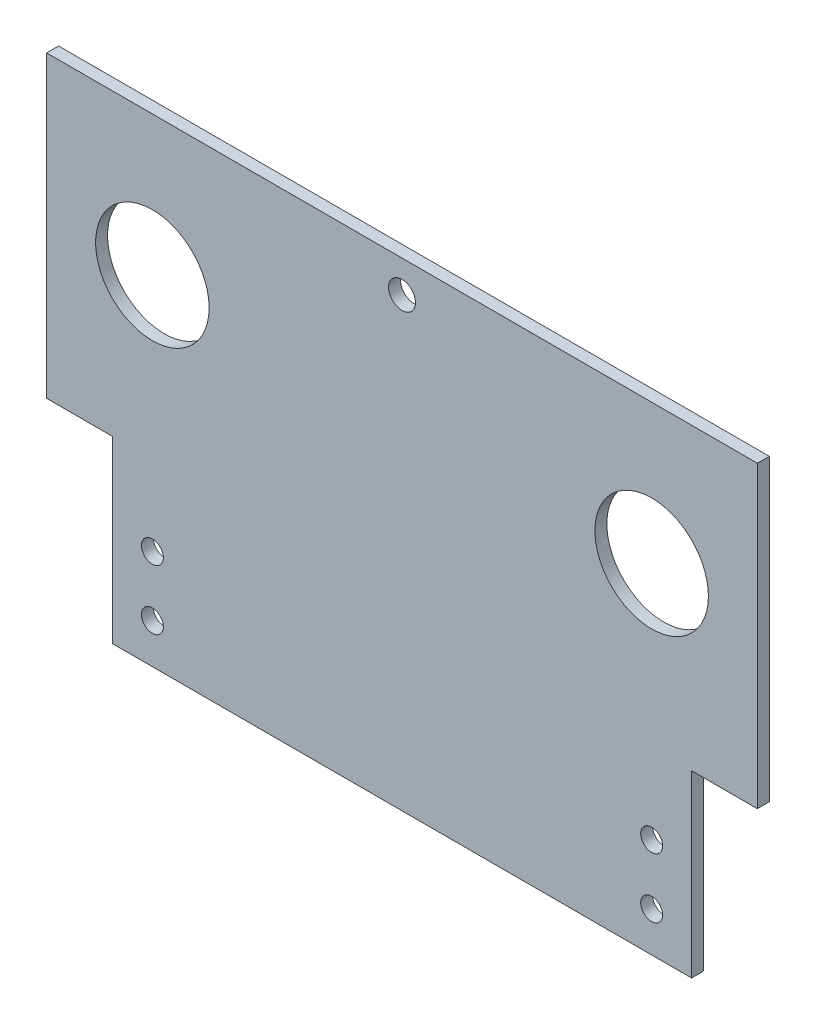
ISO-10303-21;
HEADER;
FILE_DESCRIPTION(('STEP AP214'),'2;1');
FILE_NAME('part.step','',(''),(''),'','','');
FILE_SCHEMA(('AUTOMOTIVE_DESIGN { 1 0 10303 214 1 1 1 1 }'));
ENDSEC;
DATA;
#1=APPLICATION_CONTEXT('core data for automotive mechanical design processes');
#2=APPLICATION_PROTOCOL_DEFINITION('international standard','automotive_design',2000,#1);
#3=PRODUCT_CONTEXT('',#1,'mechanical');
#4=PRODUCT('Part','Part','',(#3));
#5=PRODUCT_RELATED_PRODUCT_CATEGORY('part','',(#4));
#6=PRODUCT_DEFINITION_FORMATION('','',#4);
#7=PRODUCT_DEFINITION_CONTEXT('part definition',#1,'design');
#8=PRODUCT_DEFINITION('design','',#6,#7);
#9=PRODUCT_DEFINITION_SHAPE('','',#8);
#10=(LENGTH_UNIT() NAMED_UNIT(*) SI_UNIT(.MILLI.,.METRE.));
#11=(NAMED_UNIT(*) PLANE_ANGLE_UNIT() SI_UNIT($,.RADIAN.));
#12=(NAMED_UNIT(*) SI_UNIT($,.STERADIAN.) SOLID_ANGLE_UNIT());
#13=UNCERTAINTY_MEASURE_WITH_UNIT(LENGTH_MEASURE(1.E-05),#10,'distance_accuracy_value','');
#14=(GEOMETRIC_REPRESENTATION_CONTEXT(3) GLOBAL_UNCERTAINTY_ASSIGNED_CONTEXT((#13)) GLOBAL_UNIT_ASSIGNED_CONTEXT((#10,
#11,#12)) REPRESENTATION_CONTEXT('',''));
#15=CARTESIAN_POINT('',(0.,0.,0.));
#16=DIRECTION('',(0.,0.,1.));
#17=DIRECTION('',(1.,0.,0.));
#18=AXIS2_PLACEMENT_3D('',#15,#16,#17);
#19=CARTESIAN_POINT('',(0.,0.,3.));
#20=DIRECTION('',(1.,0.,0.));
#21=DIRECTION('',(0.,1.,0.));
#22=AXIS2_PLACEMENT_3D('',#19,#20,#21);
#23=PLANE('',#22);
#24=DIRECTION('',(0.,0.,-1.));
#25=VECTOR('',#24,1.);
#26=CARTESIAN_POINT('',(0.,-75.,3.));
#27=LINE('',#26,#25);
#28=CARTESIAN_POINT('',(0.,-75.,3.));
#29=VERTEX_POINT('',#28);
#30=CARTESIAN_POINT('',(0.,-75.,0.));
#31=VERTEX_POINT('',#30);
#32=EDGE_CURVE('E104',#29,#31,#27,.T.);
#33=ORIENTED_EDGE('',*,*,#32,.F.);
#34=DIRECTION('',(0.,-1.,0.));
#35=VECTOR('',#34,1.);
#36=CARTESIAN_POINT('',(0.,0.,3.));
#37=LINE('',#36,#35);
#38=CARTESIAN_POINT('',(0.,0.,3.));
#39=VERTEX_POINT('',#38);
#40=EDGE_CURVE('E120',#39,#29,#37,.T.);
#41=ORIENTED_EDGE('',*,*,#40,.F.);
#42=DIRECTION('',(0.,0.,-1.));
#43=VECTOR('',#42,1.);
#44=CARTESIAN_POINT('',(0.,0.,3.));
#45=LINE('',#44,#43);
#46=CARTESIAN_POINT('',(0.,0.,0.));
#47=VERTEX_POINT('',#46);
#48=EDGE_CURVE('E46',#39,#47,#45,.T.);
#49=ORIENTED_EDGE('',*,*,#48,.T.);
#50=DIRECTION('',(0.,-1.,0.));
#51=VECTOR('',#50,1.);
#52=CARTESIAN_POINT('',(0.,0.,0.));
#53=LINE('',#52,#51);
#54=EDGE_CURVE('E118',#47,#31,#53,.T.);
#55=ORIENTED_EDGE('',*,*,#54,.T.);
#56=EDGE_LOOP('',(#33,#41,#49,#55));
#57=FACE_BOUND('',#56,.T.);
#58=ADVANCED_FACE('F39',(#57),#23,.F.);
#59=CARTESIAN_POINT('',(0.,-120.,3.));
#60=DIRECTION('',(0.,1.,0.));
#61=DIRECTION('',(0.,0.,1.));
#62=AXIS2_PLACEMENT_3D('',#59,#60,#61);
#63=PLANE('',#62);
#64=DIRECTION('',(1.,0.,0.));
#65=VECTOR('',#64,1.);
#66=CARTESIAN_POINT('',(0.,-120.,3.));
#67=LINE('',#66,#65);
#68=CARTESIAN_POINT('',(16.5,-120.,3.));
#69=VERTEX_POINT('',#68);
#70=CARTESIAN_POINT('',(161.66,-120.,3.));
#71=VERTEX_POINT('',#70);
#72=EDGE_CURVE('E123',#69,#71,#67,.T.);
#73=ORIENTED_EDGE('',*,*,#72,.F.);
#74=DIRECTION('',(0.,0.,-1.));
#75=VECTOR('',#74,1.);
#76=CARTESIAN_POINT('',(16.5,-120.,3.));
#77=LINE('',#76,#75);
#78=CARTESIAN_POINT('',(16.5,-120.,0.));
#79=VERTEX_POINT('',#78);
#80=EDGE_CURVE('E160',#69,#79,#77,.T.);
#81=ORIENTED_EDGE('',*,*,#80,.T.);
#82=DIRECTION('',(1.,0.,0.));
#83=VECTOR('',#82,1.);
#84=CARTESIAN_POINT('',(0.,-120.,0.));
#85=LINE('',#84,#83);
#86=CARTESIAN_POINT('',(161.66,-120.,0.));
#87=VERTEX_POINT('',#86);
#88=EDGE_CURVE('E139',#79,#87,#85,.T.);
#89=ORIENTED_EDGE('',*,*,#88,.T.);
#90=DIRECTION('',(0.,0.,-1.));
#91=VECTOR('',#90,1.);
#92=CARTESIAN_POINT('',(161.66,-120.,3.));
#93=LINE('',#92,#91);
#94=EDGE_CURVE('E162',#71,#87,#93,.T.);
#95=ORIENTED_EDGE('',*,*,#94,.F.);
#96=EDGE_LOOP('',(#73,#81,#89,#95));
#97=FACE_BOUND('',#96,.T.);
#98=ADVANCED_FACE('F218',(#97),#63,.F.);
#99=CARTESIAN_POINT('',(0.,0.,3.));
#100=DIRECTION('',(0.,0.,1.));
#101=DIRECTION('',(1.,0.,0.));
#102=AXIS2_PLACEMENT_3D('',#99,#100,#101);
#103=PLANE('',#102);
#104=CARTESIAN_POINT('',(89.08,-8.00000000000002,3.));
#105=DIRECTION('',(0.,0.,1.));
#106=DIRECTION('',(1.,0.,0.));
#107=AXIS2_PLACEMENT_3D('',#104,#105,#106);
#108=CIRCLE('',#107,3.375);
#109=CARTESIAN_POINT('',(92.455,-8.00000000000002,3.));
#110=VERTEX_POINT('',#109);
#111=EDGE_CURVE('E193',#110,#110,#108,.T.);
#112=ORIENTED_EDGE('',*,*,#111,.F.);
#113=EDGE_LOOP('',(#112));
#114=FACE_BOUND('',#113,.T.);
#115=CARTESIAN_POINT('',(151.66,-110.,3.));
#116=DIRECTION('',(0.,0.,1.));
#117=DIRECTION('',(1.,0.,0.));
#118=AXIS2_PLACEMENT_3D('',#115,#116,#117);
#119=CIRCLE('',#118,2.75000000000001);
#120=CARTESIAN_POINT('',(154.41,-110.,3.));
#121=VERTEX_POINT('',#120);
#122=EDGE_CURVE('E189',#121,#121,#119,.T.);
#123=ORIENTED_EDGE('',*,*,#122,.F.);
#124=EDGE_LOOP('',(#123));
#125=FACE_BOUND('',#124,.T.);
#126=CARTESIAN_POINT('',(26.5,-110.,3.));
#127=DIRECTION('',(0.,0.,1.));
#128=DIRECTION('',(1.,0.,0.));
#129=AXIS2_PLACEMENT_3D('',#126,#127,#128);
#130=CIRCLE('',#129,2.75);
#131=CARTESIAN_POINT('',(29.25,-110.,3.));
#132=VERTEX_POINT('',#131);
#133=EDGE_CURVE('E207',#132,#132,#130,.T.);
#134=ORIENTED_EDGE('',*,*,#133,.F.);
#135=EDGE_LOOP('',(#134));
#136=FACE_BOUND('',#135,.T.);
#137=CARTESIAN_POINT('',(151.66,-35.,3.));
#138=DIRECTION('',(0.,0.,1.));
#139=DIRECTION('',(1.,0.,0.));
#140=AXIS2_PLACEMENT_3D('',#137,#138,#139);
#141=CIRCLE('',#140,14.225);
#142=CARTESIAN_POINT('',(165.885,-35.,3.));
#143=VERTEX_POINT('',#142);
#144=EDGE_CURVE('E197',#143,#143,#141,.T.);
#145=ORIENTED_EDGE('',*,*,#144,.F.);
#146=EDGE_LOOP('',(#145));
#147=FACE_BOUND('',#146,.T.);
#148=CARTESIAN_POINT('',(26.5,-95.,3.));
#149=DIRECTION('',(0.,0.,1.));
#150=DIRECTION('',(1.,0.,0.));
#151=AXIS2_PLACEMENT_3D('',#148,#149,#150);
#152=CIRCLE('',#151,2.75);
#153=CARTESIAN_POINT('',(29.25,-95.,3.));
#154=VERTEX_POINT('',#153);
#155=EDGE_CURVE('E176',#154,#154,#152,.T.);
#156=ORIENTED_EDGE('',*,*,#155,.F.);
#157=EDGE_LOOP('',(#156));
#158=FACE_BOUND('',#157,.T.);
#159=CARTESIAN_POINT('',(151.66,-95.,3.));
#160=DIRECTION('',(0.,0.,1.));
#161=DIRECTION('',(1.,0.,0.));
#162=AXIS2_PLACEMENT_3D('',#159,#160,#161);
#163=CIRCLE('',#162,2.75000000000001);
#164=CARTESIAN_POINT('',(154.41,-95.,3.));
#165=VERTEX_POINT('',#164);
#166=EDGE_CURVE('E182',#165,#165,#163,.T.);
#167=ORIENTED_EDGE('',*,*,#166,.F.);
#168=EDGE_LOOP('',(#167));
#169=FACE_BOUND('',#168,.T.);
#170=CARTESIAN_POINT('',(26.5,-35.,3.));
#171=DIRECTION('',(0.,0.,1.));
#172=DIRECTION('',(1.,0.,0.));
#173=AXIS2_PLACEMENT_3D('',#170,#171,#172);
#174=CIRCLE('',#173,14.225);
#175=CARTESIAN_POINT('',(40.725,-35.,3.));
#176=VERTEX_POINT('',#175);
#177=EDGE_CURVE('E133',#176,#176,#174,.T.);
#178=ORIENTED_EDGE('',*,*,#177,.F.);
#179=EDGE_LOOP('',(#178));
#180=FACE_BOUND('',#179,.T.);
#181=DIRECTION('',(1.,0.,0.));
#182=VECTOR('',#181,1.);
#183=CARTESIAN_POINT('',(0.,-75.,3.));
#184=LINE('',#183,#182);
#185=CARTESIAN_POINT('',(16.5,-75.,3.));
#186=VERTEX_POINT('',#185);
#187=EDGE_CURVE('E103',#29,#186,#184,.T.);
#188=ORIENTED_EDGE('',*,*,#187,.T.);
#189=DIRECTION('',(0.,-1.,0.));
#190=VECTOR('',#189,1.);
#191=CARTESIAN_POINT('',(16.5,-120.,3.));
#192=LINE('',#191,#190);
#193=EDGE_CURVE('E109',#186,#69,#192,.T.);
#194=ORIENTED_EDGE('',*,*,#193,.T.);
#195=ORIENTED_EDGE('',*,*,#72,.T.);
#196=DIRECTION('',(0.,1.,0.));
#197=VECTOR('',#196,1.);
#198=CARTESIAN_POINT('',(161.66,-120.,3.));
#199=LINE('',#198,#197);
#200=CARTESIAN_POINT('',(161.66,-75.,3.));
#201=VERTEX_POINT('',#200);
#202=EDGE_CURVE('E167',#71,#201,#199,.T.);
#203=ORIENTED_EDGE('',*,*,#202,.T.);
#204=DIRECTION('',(1.,0.,0.));
#205=VECTOR('',#204,1.);
#206=CARTESIAN_POINT('',(178.16,-75.,3.));
#207=LINE('',#206,#205);
#208=CARTESIAN_POINT('',(178.16,-75.,3.));
#209=VERTEX_POINT('',#208);
#210=EDGE_CURVE('E165',#201,#209,#207,.T.);
#211=ORIENTED_EDGE('',*,*,#210,.T.);
#212=DIRECTION('',(0.,1.,0.));
#213=VECTOR('',#212,1.);
#214=CARTESIAN_POINT('',(178.16,0.,3.));
#215=LINE('',#214,#213);
#216=CARTESIAN_POINT('',(178.16,0.,3.));
#217=VERTEX_POINT('',#216);
#218=EDGE_CURVE('E126',#209,#217,#215,.T.);
#219=ORIENTED_EDGE('',*,*,#218,.T.);
#220=DIRECTION('',(-1.,0.,0.));
#221=VECTOR('',#220,1.);
#222=CARTESIAN_POINT('',(0.,0.,3.));
#223=LINE('',#222,#221);
#224=EDGE_CURVE('E124',#217,#39,#223,.T.);
#225=ORIENTED_EDGE('',*,*,#224,.T.);
#226=ORIENTED_EDGE('',*,*,#40,.T.);
#227=EDGE_LOOP('',(#188,#194,#195,#203,#211,#219,#225,#226));
#228=FACE_BOUND('',#227,.T.);
#229=ADVANCED_FACE('F122',(#114,#125,#136,#147,#158,#169,#180,#228),#103,.T.);
#230=CARTESIAN_POINT('',(0.,0.,0.));
#231=DIRECTION('',(0.,0.,1.));
#232=DIRECTION('',(1.,0.,0.));
#233=AXIS2_PLACEMENT_3D('',#230,#231,#232);
#234=PLANE('',#233);
#235=CARTESIAN_POINT('',(89.08,-8.00000000000002,0.));
#236=DIRECTION('',(0.,0.,1.));
#237=DIRECTION('',(1.,0.,0.));
#238=AXIS2_PLACEMENT_3D('',#235,#236,#237);
#239=CIRCLE('',#238,3.375);
#240=CARTESIAN_POINT('',(92.455,-8.00000000000002,0.));
#241=VERTEX_POINT('',#240);
#242=EDGE_CURVE('E177',#241,#241,#239,.T.);
#243=ORIENTED_EDGE('',*,*,#242,.T.);
#244=EDGE_LOOP('',(#243));
#245=FACE_BOUND('',#244,.T.);
#246=CARTESIAN_POINT('',(151.66,-110.,0.));
#247=DIRECTION('',(0.,0.,1.));
#248=DIRECTION('',(1.,0.,0.));
#249=AXIS2_PLACEMENT_3D('',#246,#247,#248);
#250=CIRCLE('',#249,2.75000000000001);
#251=CARTESIAN_POINT('',(154.41,-110.,0.));
#252=VERTEX_POINT('',#251);
#253=EDGE_CURVE('E195',#252,#252,#250,.T.);
#254=ORIENTED_EDGE('',*,*,#253,.T.);
#255=EDGE_LOOP('',(#254));
#256=FACE_BOUND('',#255,.T.);
#257=CARTESIAN_POINT('',(26.5,-110.,0.));
#258=DIRECTION('',(0.,0.,1.));
#259=DIRECTION('',(1.,0.,0.));
#260=AXIS2_PLACEMENT_3D('',#257,#258,#259);
#261=CIRCLE('',#260,2.75);
#262=CARTESIAN_POINT('',(29.25,-110.,0.));
#263=VERTEX_POINT('',#262);
#264=EDGE_CURVE('E192',#263,#263,#261,.T.);
#265=ORIENTED_EDGE('',*,*,#264,.T.);
#266=EDGE_LOOP('',(#265));
#267=FACE_BOUND('',#266,.T.);
#268=CARTESIAN_POINT('',(151.66,-35.,0.));
#269=DIRECTION('',(0.,0.,1.));
#270=DIRECTION('',(1.,0.,0.));
#271=AXIS2_PLACEMENT_3D('',#268,#269,#270);
#272=CIRCLE('',#271,14.225);
#273=CARTESIAN_POINT('',(165.885,-35.,0.));
#274=VERTEX_POINT('',#273);
#275=EDGE_CURVE('E203',#274,#274,#272,.T.);
#276=ORIENTED_EDGE('',*,*,#275,.T.);
#277=EDGE_LOOP('',(#276));
#278=FACE_BOUND('',#277,.T.);
#279=CARTESIAN_POINT('',(26.5,-95.,0.));
#280=DIRECTION('',(0.,0.,1.));
#281=DIRECTION('',(1.,0.,0.));
#282=AXIS2_PLACEMENT_3D('',#279,#280,#281);
#283=CIRCLE('',#282,2.75);
#284=CARTESIAN_POINT('',(29.25,-95.,0.));
#285=VERTEX_POINT('',#284);
#286=EDGE_CURVE('E179',#285,#285,#283,.T.);
#287=ORIENTED_EDGE('',*,*,#286,.T.);
#288=EDGE_LOOP('',(#287));
#289=FACE_BOUND('',#288,.T.);
#290=CARTESIAN_POINT('',(151.66,-95.,0.));
#291=DIRECTION('',(0.,0.,1.));
#292=DIRECTION('',(1.,0.,0.));
#293=AXIS2_PLACEMENT_3D('',#290,#291,#292);
#294=CIRCLE('',#293,2.75000000000001);
#295=CARTESIAN_POINT('',(154.41,-95.,0.));
#296=VERTEX_POINT('',#295);
#297=EDGE_CURVE('E159',#296,#296,#294,.T.);
#298=ORIENTED_EDGE('',*,*,#297,.T.);
#299=EDGE_LOOP('',(#298));
#300=FACE_BOUND('',#299,.T.);
#301=CARTESIAN_POINT('',(26.5,-35.,0.));
#302=DIRECTION('',(0.,0.,1.));
#303=DIRECTION('',(1.,0.,0.));
#304=AXIS2_PLACEMENT_3D('',#301,#302,#303);
#305=CIRCLE('',#304,14.225);
#306=CARTESIAN_POINT('',(40.725,-35.,0.));
#307=VERTEX_POINT('',#306);
#308=EDGE_CURVE('E142',#307,#307,#305,.T.);
#309=ORIENTED_EDGE('',*,*,#308,.T.);
#310=EDGE_LOOP('',(#309));
#311=FACE_BOUND('',#310,.T.);
#312=DIRECTION('',(1.,0.,0.));
#313=VECTOR('',#312,1.);
#314=CARTESIAN_POINT('',(0.,-75.,0.));
#315=LINE('',#314,#313);
#316=CARTESIAN_POINT('',(16.5,-75.,0.));
#317=VERTEX_POINT('',#316);
#318=EDGE_CURVE('E52',#31,#317,#315,.T.);
#319=ORIENTED_EDGE('',*,*,#318,.F.);
#320=ORIENTED_EDGE('',*,*,#54,.F.);
#321=DIRECTION('',(-1.,0.,0.));
#322=VECTOR('',#321,1.);
#323=CARTESIAN_POINT('',(0.,0.,0.));
#324=LINE('',#323,#322);
#325=CARTESIAN_POINT('',(178.16,0.,0.));
#326=VERTEX_POINT('',#325);
#327=EDGE_CURVE('E127',#326,#47,#324,.T.);
#328=ORIENTED_EDGE('',*,*,#327,.F.);
#329=DIRECTION('',(0.,1.,0.));
#330=VECTOR('',#329,1.);
#331=CARTESIAN_POINT('',(178.16,0.,0.));
#332=LINE('',#331,#330);
#333=CARTESIAN_POINT('',(178.16,-75.,0.));
#334=VERTEX_POINT('',#333);
#335=EDGE_CURVE('E134',#334,#326,#332,.T.);
#336=ORIENTED_EDGE('',*,*,#335,.F.);
#337=DIRECTION('',(1.,0.,0.));
#338=VECTOR('',#337,1.);
#339=CARTESIAN_POINT('',(178.16,-75.,0.));
#340=LINE('',#339,#338);
#341=CARTESIAN_POINT('',(161.66,-75.,0.));
#342=VERTEX_POINT('',#341);
#343=EDGE_CURVE('E155',#342,#334,#340,.T.);
#344=ORIENTED_EDGE('',*,*,#343,.F.);
#345=DIRECTION('',(0.,1.,0.));
#346=VECTOR('',#345,1.);
#347=CARTESIAN_POINT('',(161.66,-120.,0.));
#348=LINE('',#347,#346);
#349=EDGE_CURVE('E62',#87,#342,#348,.T.);
#350=ORIENTED_EDGE('',*,*,#349,.F.);
#351=ORIENTED_EDGE('',*,*,#88,.F.);
#352=DIRECTION('',(0.,-1.,0.));
#353=VECTOR('',#352,1.);
#354=CARTESIAN_POINT('',(16.5,-120.,0.));
#355=LINE('',#354,#353);
#356=EDGE_CURVE('E111',#317,#79,#355,.T.);
#357=ORIENTED_EDGE('',*,*,#356,.F.);
#358=EDGE_LOOP('',(#319,#320,#328,#336,#344,#350,#351,#357));
#359=FACE_BOUND('',#358,.T.);
#360=ADVANCED_FACE('F150',(#245,#256,#267,#278,#289,#300,#311,#359),#234,.F.);
#361=CARTESIAN_POINT('',(178.16,0.,3.));
#362=DIRECTION('',(-1.,0.,0.));
#363=DIRECTION('',(0.,-1.,0.));
#364=AXIS2_PLACEMENT_3D('',#361,#362,#363);
#365=PLANE('',#364);
#366=ORIENTED_EDGE('',*,*,#218,.F.);
#367=DIRECTION('',(0.,0.,-1.));
#368=VECTOR('',#367,1.);
#369=CARTESIAN_POINT('',(178.16,-75.,3.));
#370=LINE('',#369,#368);
#371=EDGE_CURVE('E170',#209,#334,#370,.T.);
#372=ORIENTED_EDGE('',*,*,#371,.T.);
#373=ORIENTED_EDGE('',*,*,#335,.T.);
#374=DIRECTION('',(0.,0.,-1.));
#375=VECTOR('',#374,1.);
#376=CARTESIAN_POINT('',(178.16,0.,3.));
#377=LINE('',#376,#375);
#378=EDGE_CURVE('E11',#217,#326,#377,.T.);
#379=ORIENTED_EDGE('',*,*,#378,.F.);
#380=EDGE_LOOP('',(#366,#372,#373,#379));
#381=FACE_BOUND('',#380,.T.);
#382=ADVANCED_FACE('F228',(#381),#365,.F.);
#383=CARTESIAN_POINT('',(0.,0.,3.));
#384=DIRECTION('',(0.,-1.,0.));
#385=DIRECTION('',(0.,0.,-1.));
#386=AXIS2_PLACEMENT_3D('',#383,#384,#385);
#387=PLANE('',#386);
#388=ORIENTED_EDGE('',*,*,#327,.T.);
#389=ORIENTED_EDGE('',*,*,#48,.F.);
#390=ORIENTED_EDGE('',*,*,#224,.F.);
#391=ORIENTED_EDGE('',*,*,#378,.T.);
#392=EDGE_LOOP('',(#388,#389,#390,#391));
#393=FACE_BOUND('',#392,.T.);
#394=ADVANCED_FACE('F314',(#393),#387,.F.);
#395=CARTESIAN_POINT('',(26.5,-35.,0.));
#396=DIRECTION('',(0.,0.,1.));
#397=DIRECTION('',(1.,0.,0.));
#398=AXIS2_PLACEMENT_3D('',#395,#396,#397);
#399=CYLINDRICAL_SURFACE('',#398,14.225);
#400=ORIENTED_EDGE('',*,*,#308,.F.);
#401=EDGE_LOOP('',(#400));
#402=FACE_BOUND('',#401,.T.);
#403=ORIENTED_EDGE('',*,*,#177,.T.);
#404=EDGE_LOOP('',(#403));
#405=FACE_BOUND('',#404,.T.);
#406=ADVANCED_FACE('F219',(#402,#405),#399,.F.);
#407=CARTESIAN_POINT('',(151.66,-95.,0.));
#408=DIRECTION('',(0.,0.,1.));
#409=DIRECTION('',(1.,0.,0.));
#410=AXIS2_PLACEMENT_3D('',#407,#408,#409);
#411=CYLINDRICAL_SURFACE('',#410,2.75000000000001);
#412=ORIENTED_EDGE('',*,*,#297,.F.);
#413=EDGE_LOOP('',(#412));
#414=FACE_BOUND('',#413,.T.);
#415=ORIENTED_EDGE('',*,*,#166,.T.);
#416=EDGE_LOOP('',(#415));
#417=FACE_BOUND('',#416,.T.);
#418=ADVANCED_FACE('F296',(#414,#417),#411,.F.);
#419=CARTESIAN_POINT('',(26.5,-95.,0.));
#420=DIRECTION('',(0.,0.,1.));
#421=DIRECTION('',(1.,0.,0.));
#422=AXIS2_PLACEMENT_3D('',#419,#420,#421);
#423=CYLINDRICAL_SURFACE('',#422,2.75);
#424=ORIENTED_EDGE('',*,*,#286,.F.);
#425=EDGE_LOOP('',(#424));
#426=FACE_BOUND('',#425,.T.);
#427=ORIENTED_EDGE('',*,*,#155,.T.);
#428=EDGE_LOOP('',(#427));
#429=FACE_BOUND('',#428,.T.);
#430=ADVANCED_FACE('F287',(#426,#429),#423,.F.);
#431=CARTESIAN_POINT('',(151.66,-35.,0.));
#432=DIRECTION('',(0.,0.,1.));
#433=DIRECTION('',(1.,0.,0.));
#434=AXIS2_PLACEMENT_3D('',#431,#432,#433);
#435=CYLINDRICAL_SURFACE('',#434,14.225);
#436=ORIENTED_EDGE('',*,*,#275,.F.);
#437=EDGE_LOOP('',(#436));
#438=FACE_BOUND('',#437,.T.);
#439=ORIENTED_EDGE('',*,*,#144,.T.);
#440=EDGE_LOOP('',(#439));
#441=FACE_BOUND('',#440,.T.);
#442=ADVANCED_FACE('F278',(#438,#441),#435,.F.);
#443=CARTESIAN_POINT('',(26.5,-110.,0.));
#444=DIRECTION('',(0.,0.,1.));
#445=DIRECTION('',(1.,0.,0.));
#446=AXIS2_PLACEMENT_3D('',#443,#444,#445);
#447=CYLINDRICAL_SURFACE('',#446,2.75);
#448=ORIENTED_EDGE('',*,*,#264,.F.);
#449=EDGE_LOOP('',(#448));
#450=FACE_BOUND('',#449,.T.);
#451=ORIENTED_EDGE('',*,*,#133,.T.);
#452=EDGE_LOOP('',(#451));
#453=FACE_BOUND('',#452,.T.);
#454=ADVANCED_FACE('F272',(#450,#453),#447,.F.);
#455=CARTESIAN_POINT('',(151.66,-110.,0.));
#456=DIRECTION('',(0.,0.,1.));
#457=DIRECTION('',(1.,0.,0.));
#458=AXIS2_PLACEMENT_3D('',#455,#456,#457);
#459=CYLINDRICAL_SURFACE('',#458,2.75000000000001);
#460=ORIENTED_EDGE('',*,*,#253,.F.);
#461=EDGE_LOOP('',(#460));
#462=FACE_BOUND('',#461,.T.);
#463=ORIENTED_EDGE('',*,*,#122,.T.);
#464=EDGE_LOOP('',(#463));
#465=FACE_BOUND('',#464,.T.);
#466=ADVANCED_FACE('F265',(#462,#465),#459,.F.);
#467=CARTESIAN_POINT('',(89.08,-8.00000000000002,0.));
#468=DIRECTION('',(0.,0.,1.));
#469=DIRECTION('',(1.,0.,0.));
#470=AXIS2_PLACEMENT_3D('',#467,#468,#469);
#471=CYLINDRICAL_SURFACE('',#470,3.375);
#472=ORIENTED_EDGE('',*,*,#242,.F.);
#473=EDGE_LOOP('',(#472));
#474=FACE_BOUND('',#473,.T.);
#475=ORIENTED_EDGE('',*,*,#111,.T.);
#476=EDGE_LOOP('',(#475));
#477=FACE_BOUND('',#476,.T.);
#478=ADVANCED_FACE('F241',(#474,#477),#471,.F.);
#479=CARTESIAN_POINT('',(178.16,-75.,3.));
#480=DIRECTION('',(0.,1.,0.));
#481=DIRECTION('',(0.,0.,1.));
#482=AXIS2_PLACEMENT_3D('',#479,#480,#481);
#483=PLANE('',#482);
#484=ORIENTED_EDGE('',*,*,#343,.T.);
#485=ORIENTED_EDGE('',*,*,#371,.F.);
#486=ORIENTED_EDGE('',*,*,#210,.F.);
#487=DIRECTION('',(0.,0.,-1.));
#488=VECTOR('',#487,1.);
#489=CARTESIAN_POINT('',(161.66,-75.,3.));
#490=LINE('',#489,#488);
#491=EDGE_CURVE('E164',#201,#342,#490,.T.);
#492=ORIENTED_EDGE('',*,*,#491,.T.);
#493=EDGE_LOOP('',(#484,#485,#486,#492));
#494=FACE_BOUND('',#493,.T.);
#495=ADVANCED_FACE('F261',(#494),#483,.F.);
#496=CARTESIAN_POINT('',(161.66,-120.,3.));
#497=DIRECTION('',(-1.,0.,0.));
#498=DIRECTION('',(0.,0.,1.));
#499=AXIS2_PLACEMENT_3D('',#496,#497,#498);
#500=PLANE('',#499);
#501=ORIENTED_EDGE('',*,*,#349,.T.);
#502=ORIENTED_EDGE('',*,*,#491,.F.);
#503=ORIENTED_EDGE('',*,*,#202,.F.);
#504=ORIENTED_EDGE('',*,*,#94,.T.);
#505=EDGE_LOOP('',(#501,#502,#503,#504));
#506=FACE_BOUND('',#505,.T.);
#507=ADVANCED_FACE('F339',(#506),#500,.F.);
#508=CARTESIAN_POINT('',(16.5,-120.,3.));
#509=DIRECTION('',(1.,0.,0.));
#510=DIRECTION('',(0.,0.,-1.));
#511=AXIS2_PLACEMENT_3D('',#508,#509,#510);
#512=PLANE('',#511);
#513=ORIENTED_EDGE('',*,*,#356,.T.);
#514=ORIENTED_EDGE('',*,*,#80,.F.);
#515=ORIENTED_EDGE('',*,*,#193,.F.);
#516=DIRECTION('',(0.,0.,-1.));
#517=VECTOR('',#516,1.);
#518=CARTESIAN_POINT('',(16.5,-75.,3.));
#519=LINE('',#518,#517);
#520=EDGE_CURVE('E102',#186,#317,#519,.T.);
#521=ORIENTED_EDGE('',*,*,#520,.T.);
#522=EDGE_LOOP('',(#513,#514,#515,#521));
#523=FACE_BOUND('',#522,.T.);
#524=ADVANCED_FACE('F346',(#523),#512,.F.);
#525=CARTESIAN_POINT('',(0.,-75.,3.));
#526=DIRECTION('',(0.,1.,0.));
#527=DIRECTION('',(0.,0.,1.));
#528=AXIS2_PLACEMENT_3D('',#525,#526,#527);
#529=PLANE('',#528);
#530=ORIENTED_EDGE('',*,*,#318,.T.);
#531=ORIENTED_EDGE('',*,*,#520,.F.);
#532=ORIENTED_EDGE('',*,*,#187,.F.);
#533=ORIENTED_EDGE('',*,*,#32,.T.);
#534=EDGE_LOOP('',(#530,#531,#532,#533));
#535=FACE_BOUND('',#534,.T.);
#536=ADVANCED_FACE('F101',(#535),#529,.F.);
#537=CLOSED_SHELL('',(#58,#98,#229,#360,#382,#394,#406,#418,#430,#442,#454,#466,#478,#495,#507,
#524,#536));
#538=MANIFOLD_SOLID_BREP('B2',#537);
#539=ADVANCED_BREP_SHAPE_REPRESENTATION('',(#18,#538),#14);
#540=SHAPE_DEFINITION_REPRESENTATION(#9,#539);
ENDSEC;
END-ISO-10303-21;
